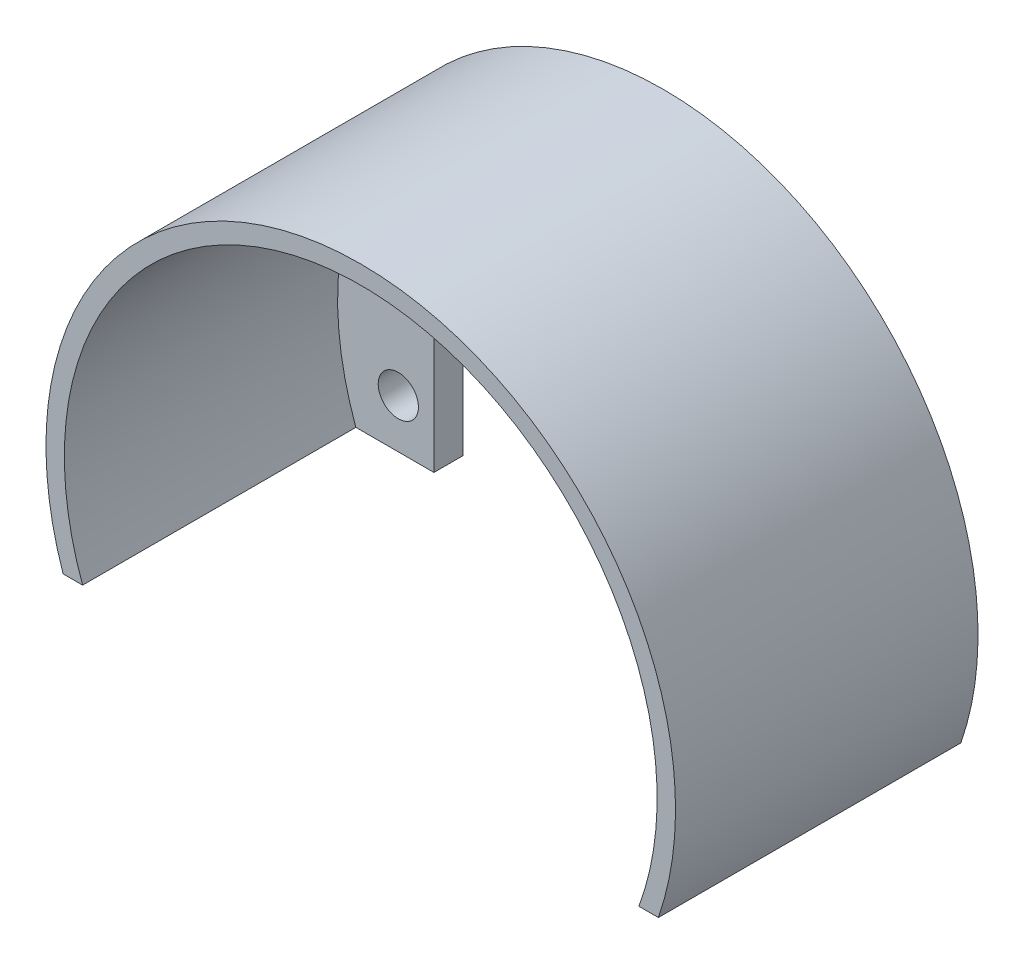
ISO-10303-21;
HEADER;
FILE_DESCRIPTION(('STEP AP214'),'2;1');
FILE_NAME('part.step','',(''),(''),'','','');
FILE_SCHEMA(('AUTOMOTIVE_DESIGN { 1 0 10303 214 1 1 1 1 }'));
ENDSEC;
DATA;
#1=APPLICATION_CONTEXT('core data for automotive mechanical design processes');
#2=APPLICATION_PROTOCOL_DEFINITION('international standard','automotive_design',2000,#1);
#3=PRODUCT_CONTEXT('',#1,'mechanical');
#4=PRODUCT('Part','Part','',(#3));
#5=PRODUCT_RELATED_PRODUCT_CATEGORY('part','',(#4));
#6=PRODUCT_DEFINITION_FORMATION('','',#4);
#7=PRODUCT_DEFINITION_CONTEXT('part definition',#1,'design');
#8=PRODUCT_DEFINITION('design','',#6,#7);
#9=PRODUCT_DEFINITION_SHAPE('','',#8);
#10=(LENGTH_UNIT() NAMED_UNIT(*) SI_UNIT(.MILLI.,.METRE.));
#11=(NAMED_UNIT(*) PLANE_ANGLE_UNIT() SI_UNIT($,.RADIAN.));
#12=(NAMED_UNIT(*) SI_UNIT($,.STERADIAN.) SOLID_ANGLE_UNIT());
#13=UNCERTAINTY_MEASURE_WITH_UNIT(LENGTH_MEASURE(1.E-05),#10,'distance_accuracy_value','');
#14=(GEOMETRIC_REPRESENTATION_CONTEXT(3) GLOBAL_UNCERTAINTY_ASSIGNED_CONTEXT((#13)) GLOBAL_UNIT_ASSIGNED_CONTEXT((#10,
#11,#12)) REPRESENTATION_CONTEXT('',''));
#15=CARTESIAN_POINT('',(0.,0.,0.));
#16=DIRECTION('',(0.,0.,1.));
#17=DIRECTION('',(1.,0.,0.));
#18=AXIS2_PLACEMENT_3D('',#15,#16,#17);
#19=CARTESIAN_POINT('',(2.85523596518771,11.6515735945376,3.));
#20=DIRECTION('',(0.,0.,-1.));
#21=DIRECTION('',(-1.,0.,0.));
#22=AXIS2_PLACEMENT_3D('',#19,#20,#21);
#23=PLANE('',#22);
#24=CARTESIAN_POINT('',(27.0052359651877,16.1515735945376,3.));
#25=DIRECTION('',(0.,0.,1.));
#26=DIRECTION('',(-1.,0.,0.));
#27=AXIS2_PLACEMENT_3D('',#24,#25,#26);
#28=CIRCLE('',#27,2.06094666766043);
#29=CARTESIAN_POINT('',(24.9442892975273,16.1515735945376,3.));
#30=VERTEX_POINT('',#29);
#31=EDGE_CURVE('E133',#30,#30,#28,.T.);
#32=ORIENTED_EDGE('',*,*,#31,.F.);
#33=EDGE_LOOP('',(#32));
#34=FACE_BOUND('',#33,.T.);
#35=CARTESIAN_POINT('',(-21.2947640348123,16.1515735945376,3.));
#36=DIRECTION('',(0.,0.,1.));
#37=DIRECTION('',(1.,0.,0.));
#38=AXIS2_PLACEMENT_3D('',#35,#36,#37);
#39=CIRCLE('',#38,2.06094666766043);
#40=CARTESIAN_POINT('',(-19.2338173671519,16.1515735945376,3.));
#41=VERTEX_POINT('',#40);
#42=EDGE_CURVE('E139',#41,#41,#39,.T.);
#43=ORIENTED_EDGE('',*,*,#42,.F.);
#44=EDGE_LOOP('',(#43));
#45=FACE_BOUND('',#44,.T.);
#46=CARTESIAN_POINT('',(-21.2947640348123,6.15157359453762,3.));
#47=DIRECTION('',(0.,0.,1.));
#48=DIRECTION('',(-1.,0.,0.));
#49=AXIS2_PLACEMENT_3D('',#46,#47,#48);
#50=CIRCLE('',#49,2.06094666766043);
#51=CARTESIAN_POINT('',(-23.3557107024727,6.15157359453762,3.));
#52=VERTEX_POINT('',#51);
#53=EDGE_CURVE('E145',#52,#52,#50,.T.);
#54=ORIENTED_EDGE('',*,*,#53,.F.);
#55=EDGE_LOOP('',(#54));
#56=FACE_BOUND('',#55,.T.);
#57=CARTESIAN_POINT('',(27.0052359651877,6.15157359453762,3.));
#58=DIRECTION('',(0.,0.,1.));
#59=DIRECTION('',(1.,0.,0.));
#60=AXIS2_PLACEMENT_3D('',#57,#58,#59);
#61=CIRCLE('',#60,2.06094666766043);
#62=CARTESIAN_POINT('',(29.0661826328481,6.15157359453762,3.));
#63=VERTEX_POINT('',#62);
#64=EDGE_CURVE('E151',#63,#63,#61,.T.);
#65=ORIENTED_EDGE('',*,*,#64,.F.);
#66=EDGE_LOOP('',(#65));
#67=FACE_BOUND('',#66,.T.);
#68=CARTESIAN_POINT('',(2.85523596518771,11.6515735945376,3.));
#69=DIRECTION('',(0.,0.,-1.));
#70=DIRECTION('',(-1.,0.,0.));
#71=AXIS2_PLACEMENT_3D('',#68,#69,#70);
#72=CIRCLE('',#71,30.3726850969749);
#73=CARTESIAN_POINT('',(-25.6447640348123,1.15157359453762,3.));
#74=VERTEX_POINT('',#73);
#75=CARTESIAN_POINT('',(31.3552359651877,1.15157359453763,3.));
#76=VERTEX_POINT('',#75);
#77=EDGE_CURVE('E48',#74,#76,#72,.T.);
#78=ORIENTED_EDGE('',*,*,#77,.F.);
#79=DIRECTION('',(1.,0.,0.));
#80=VECTOR('',#79,1.);
#81=CARTESIAN_POINT('',(-17.6447640348123,1.15157359453762,3.));
#82=LINE('',#81,#80);
#83=CARTESIAN_POINT('',(-17.6447640348123,1.15157359453762,3.));
#84=VERTEX_POINT('',#83);
#85=EDGE_CURVE('E87',#74,#84,#82,.T.);
#86=ORIENTED_EDGE('',*,*,#85,.T.);
#87=DIRECTION('',(0.,1.,0.));
#88=VECTOR('',#87,1.);
#89=CARTESIAN_POINT('',(-17.6447640348123,22.1515735945376,3.));
#90=LINE('',#89,#88);
#91=CARTESIAN_POINT('',(-17.6447640348123,22.1515735945376,3.));
#92=VERTEX_POINT('',#91);
#93=EDGE_CURVE('E157',#84,#92,#90,.T.);
#94=ORIENTED_EDGE('',*,*,#93,.T.);
#95=DIRECTION('',(1.,0.,0.));
#96=VECTOR('',#95,1.);
#97=CARTESIAN_POINT('',(-17.6447640348123,22.1515735945376,3.));
#98=LINE('',#97,#96);
#99=CARTESIAN_POINT('',(23.3552359651877,22.1515735945376,3.));
#100=VERTEX_POINT('',#99);
#101=EDGE_CURVE('E159',#92,#100,#98,.T.);
#102=ORIENTED_EDGE('',*,*,#101,.T.);
#103=DIRECTION('',(0.,-1.,0.));
#104=VECTOR('',#103,1.);
#105=CARTESIAN_POINT('',(23.3552359651877,22.1515735945376,3.));
#106=LINE('',#105,#104);
#107=CARTESIAN_POINT('',(23.3552359651877,1.15157359453762,3.));
#108=VERTEX_POINT('',#107);
#109=EDGE_CURVE('E55',#100,#108,#106,.T.);
#110=ORIENTED_EDGE('',*,*,#109,.T.);
#111=DIRECTION('',(1.,0.,0.));
#112=VECTOR('',#111,1.);
#113=CARTESIAN_POINT('',(23.3552359651877,1.15157359453762,3.));
#114=LINE('',#113,#112);
#115=EDGE_CURVE('E162',#108,#76,#114,.T.);
#116=ORIENTED_EDGE('',*,*,#115,.T.);
#117=EDGE_LOOP('',(#78,#86,#94,#102,#110,#116));
#118=FACE_BOUND('',#117,.T.);
#119=ADVANCED_FACE('F33',(#34,#45,#56,#67,#118),#23,.F.);
#120=CARTESIAN_POINT('',(2.85523596518771,11.6515735945376,0.));
#121=DIRECTION('',(0.,0.,-1.));
#122=DIRECTION('',(-1.,0.,0.));
#123=AXIS2_PLACEMENT_3D('',#120,#121,#122);
#124=PLANE('',#123);
#125=CARTESIAN_POINT('',(-21.2947640348123,16.1515735945376,0.));
#126=DIRECTION('',(0.,0.,1.));
#127=DIRECTION('',(1.,0.,0.));
#128=AXIS2_PLACEMENT_3D('',#125,#126,#127);
#129=CIRCLE('',#128,2.06094666766043);
#130=CARTESIAN_POINT('',(-19.2338173671519,16.1515735945376,0.));
#131=VERTEX_POINT('',#130);
#132=EDGE_CURVE('E136',#131,#131,#129,.T.);
#133=ORIENTED_EDGE('',*,*,#132,.T.);
#134=EDGE_LOOP('',(#133));
#135=FACE_BOUND('',#134,.T.);
#136=CARTESIAN_POINT('',(27.0052359651877,6.15157359453762,0.));
#137=DIRECTION('',(0.,0.,1.));
#138=DIRECTION('',(1.,0.,0.));
#139=AXIS2_PLACEMENT_3D('',#136,#137,#138);
#140=CIRCLE('',#139,2.06094666766043);
#141=CARTESIAN_POINT('',(29.0661826328481,6.15157359453762,0.));
#142=VERTEX_POINT('',#141);
#143=EDGE_CURVE('E148',#142,#142,#140,.T.);
#144=ORIENTED_EDGE('',*,*,#143,.T.);
#145=EDGE_LOOP('',(#144));
#146=FACE_BOUND('',#145,.T.);
#147=CARTESIAN_POINT('',(2.85523596518771,11.6515735945376,0.));
#148=DIRECTION('',(0.,0.,1.));
#149=DIRECTION('',(-1.,0.,0.));
#150=AXIS2_PLACEMENT_3D('',#147,#148,#149);
#151=CIRCLE('',#150,32.2567822325786);
#152=CARTESIAN_POINT('',(33.3552359651877,1.15157359453762,0.));
#153=VERTEX_POINT('',#152);
#154=CARTESIAN_POINT('',(-27.6447640348123,1.15157359453762,0.));
#155=VERTEX_POINT('',#154);
#156=EDGE_CURVE('E108',#153,#155,#151,.T.);
#157=ORIENTED_EDGE('',*,*,#156,.F.);
#158=DIRECTION('',(1.,0.,0.));
#159=VECTOR('',#158,1.);
#160=CARTESIAN_POINT('',(23.3552359651877,1.15157359453762,0.));
#161=LINE('',#160,#159);
#162=CARTESIAN_POINT('',(23.3552359651877,1.15157359453762,0.));
#163=VERTEX_POINT('',#162);
#164=EDGE_CURVE('E83',#163,#153,#161,.T.);
#165=ORIENTED_EDGE('',*,*,#164,.F.);
#166=DIRECTION('',(0.,-1.,0.));
#167=VECTOR('',#166,1.);
#168=CARTESIAN_POINT('',(23.3552359651877,22.1515735945376,0.));
#169=LINE('',#168,#167);
#170=CARTESIAN_POINT('',(23.3552359651877,22.1515735945376,0.));
#171=VERTEX_POINT('',#170);
#172=EDGE_CURVE('E172',#171,#163,#169,.T.);
#173=ORIENTED_EDGE('',*,*,#172,.F.);
#174=DIRECTION('',(1.,0.,0.));
#175=VECTOR('',#174,1.);
#176=CARTESIAN_POINT('',(-17.6447640348123,22.1515735945376,0.));
#177=LINE('',#176,#175);
#178=CARTESIAN_POINT('',(-17.6447640348123,22.1515735945376,0.));
#179=VERTEX_POINT('',#178);
#180=EDGE_CURVE('E170',#179,#171,#177,.T.);
#181=ORIENTED_EDGE('',*,*,#180,.F.);
#182=DIRECTION('',(0.,1.,0.));
#183=VECTOR('',#182,1.);
#184=CARTESIAN_POINT('',(-17.6447640348123,22.1515735945376,0.));
#185=LINE('',#184,#183);
#186=CARTESIAN_POINT('',(-17.6447640348123,1.15157359453762,0.));
#187=VERTEX_POINT('',#186);
#188=EDGE_CURVE('E168',#187,#179,#185,.T.);
#189=ORIENTED_EDGE('',*,*,#188,.F.);
#190=DIRECTION('',(1.,0.,0.));
#191=VECTOR('',#190,1.);
#192=CARTESIAN_POINT('',(-17.6447640348123,1.15157359453762,0.));
#193=LINE('',#192,#191);
#194=EDGE_CURVE('E166',#155,#187,#193,.T.);
#195=ORIENTED_EDGE('',*,*,#194,.F.);
#196=EDGE_LOOP('',(#157,#165,#173,#181,#189,#195));
#197=FACE_BOUND('',#196,.T.);
#198=CARTESIAN_POINT('',(-21.2947640348123,6.15157359453762,0.));
#199=DIRECTION('',(0.,0.,1.));
#200=DIRECTION('',(-1.,0.,0.));
#201=AXIS2_PLACEMENT_3D('',#198,#199,#200);
#202=CIRCLE('',#201,2.06094666766043);
#203=CARTESIAN_POINT('',(-23.3557107024727,6.15157359453762,0.));
#204=VERTEX_POINT('',#203);
#205=EDGE_CURVE('E142',#204,#204,#202,.T.);
#206=ORIENTED_EDGE('',*,*,#205,.T.);
#207=EDGE_LOOP('',(#206));
#208=FACE_BOUND('',#207,.T.);
#209=CARTESIAN_POINT('',(27.0052359651877,16.1515735945376,0.));
#210=DIRECTION('',(0.,0.,1.));
#211=DIRECTION('',(-1.,0.,0.));
#212=AXIS2_PLACEMENT_3D('',#209,#210,#211);
#213=CIRCLE('',#212,2.06094666766043);
#214=CARTESIAN_POINT('',(24.9442892975273,16.1515735945376,0.));
#215=VERTEX_POINT('',#214);
#216=EDGE_CURVE('E132',#215,#215,#213,.T.);
#217=ORIENTED_EDGE('',*,*,#216,.T.);
#218=EDGE_LOOP('',(#217));
#219=FACE_BOUND('',#218,.T.);
#220=ADVANCED_FACE('F191',(#135,#146,#197,#208,#219),#124,.T.);
#221=CARTESIAN_POINT('',(2.85523596518771,11.6515735945376,3.));
#222=DIRECTION('',(0.,0.,-1.));
#223=DIRECTION('',(-1.,0.,0.));
#224=AXIS2_PLACEMENT_3D('',#221,#222,#223);
#225=CYLINDRICAL_SURFACE('',#224,32.2567822325786);
#226=ORIENTED_EDGE('',*,*,#156,.T.);
#227=DIRECTION('',(0.,0.,-1.));
#228=VECTOR('',#227,1.);
#229=CARTESIAN_POINT('',(-27.6447640348123,1.15157359453762,3.));
#230=LINE('',#229,#228);
#231=CARTESIAN_POINT('',(-27.6447640348123,1.15157359453762,31.));
#232=VERTEX_POINT('',#231);
#233=EDGE_CURVE('E11',#232,#155,#230,.T.);
#234=ORIENTED_EDGE('',*,*,#233,.F.);
#235=CARTESIAN_POINT('',(2.85523596518771,11.6515735945376,31.));
#236=DIRECTION('',(0.,0.,1.));
#237=DIRECTION('',(-1.,0.,0.));
#238=AXIS2_PLACEMENT_3D('',#235,#236,#237);
#239=CIRCLE('',#238,32.2567822325786);
#240=CARTESIAN_POINT('',(33.3552359651877,1.15157359453762,31.));
#241=VERTEX_POINT('',#240);
#242=EDGE_CURVE('E106',#241,#232,#239,.T.);
#243=ORIENTED_EDGE('',*,*,#242,.F.);
#244=DIRECTION('',(0.,0.,-1.));
#245=VECTOR('',#244,1.);
#246=CARTESIAN_POINT('',(33.3552359651877,1.15157359453762,3.));
#247=LINE('',#246,#245);
#248=EDGE_CURVE('E164',#241,#153,#247,.T.);
#249=ORIENTED_EDGE('',*,*,#248,.T.);
#250=EDGE_LOOP('',(#226,#234,#243,#249));
#251=FACE_BOUND('',#250,.T.);
#252=ADVANCED_FACE('F35',(#251),#225,.T.);
#253=CARTESIAN_POINT('',(-17.6447640348123,1.15157359453762,3.));
#254=DIRECTION('',(0.,1.,0.));
#255=DIRECTION('',(-1.,0.,0.));
#256=AXIS2_PLACEMENT_3D('',#253,#254,#255);
#257=PLANE('',#256);
#258=ORIENTED_EDGE('',*,*,#194,.T.);
#259=DIRECTION('',(0.,0.,-1.));
#260=VECTOR('',#259,1.);
#261=CARTESIAN_POINT('',(-17.6447640348123,1.15157359453762,3.));
#262=LINE('',#261,#260);
#263=EDGE_CURVE('E41',#84,#187,#262,.T.);
#264=ORIENTED_EDGE('',*,*,#263,.F.);
#265=ORIENTED_EDGE('',*,*,#85,.F.);
#266=DIRECTION('',(0.,0.,-1.));
#267=VECTOR('',#266,1.);
#268=CARTESIAN_POINT('',(-25.6447640348123,1.15157359453762,31.));
#269=LINE('',#268,#267);
#270=CARTESIAN_POINT('',(-25.6447640348123,1.15157359453762,31.));
#271=VERTEX_POINT('',#270);
#272=EDGE_CURVE('E114',#271,#74,#269,.T.);
#273=ORIENTED_EDGE('',*,*,#272,.F.);
#274=DIRECTION('',(1.,0.,0.));
#275=VECTOR('',#274,1.);
#276=CARTESIAN_POINT('',(-27.6447640348123,1.15157359453762,31.));
#277=LINE('',#276,#275);
#278=EDGE_CURVE('E111',#232,#271,#277,.T.);
#279=ORIENTED_EDGE('',*,*,#278,.F.);
#280=ORIENTED_EDGE('',*,*,#233,.T.);
#281=EDGE_LOOP('',(#258,#264,#265,#273,#279,#280));
#282=FACE_BOUND('',#281,.T.);
#283=ADVANCED_FACE('F112',(#282),#257,.F.);
#284=CARTESIAN_POINT('',(-17.6447640348123,22.1515735945376,3.));
#285=DIRECTION('',(-1.,0.,0.));
#286=DIRECTION('',(0.,-1.,0.));
#287=AXIS2_PLACEMENT_3D('',#284,#285,#286);
#288=PLANE('',#287);
#289=ORIENTED_EDGE('',*,*,#188,.T.);
#290=DIRECTION('',(0.,0.,-1.));
#291=VECTOR('',#290,1.);
#292=CARTESIAN_POINT('',(-17.6447640348123,22.1515735945376,3.));
#293=LINE('',#292,#291);
#294=EDGE_CURVE('E181',#92,#179,#293,.T.);
#295=ORIENTED_EDGE('',*,*,#294,.F.);
#296=ORIENTED_EDGE('',*,*,#93,.F.);
#297=ORIENTED_EDGE('',*,*,#263,.T.);
#298=EDGE_LOOP('',(#289,#295,#296,#297));
#299=FACE_BOUND('',#298,.T.);
#300=ADVANCED_FACE('F187',(#299),#288,.F.);
#301=CARTESIAN_POINT('',(-17.6447640348123,22.1515735945376,3.));
#302=DIRECTION('',(0.,1.,0.));
#303=DIRECTION('',(-1.,0.,0.));
#304=AXIS2_PLACEMENT_3D('',#301,#302,#303);
#305=PLANE('',#304);
#306=ORIENTED_EDGE('',*,*,#180,.T.);
#307=DIRECTION('',(0.,0.,-1.));
#308=VECTOR('',#307,1.);
#309=CARTESIAN_POINT('',(23.3552359651877,22.1515735945376,3.));
#310=LINE('',#309,#308);
#311=EDGE_CURVE('E178',#100,#171,#310,.T.);
#312=ORIENTED_EDGE('',*,*,#311,.F.);
#313=ORIENTED_EDGE('',*,*,#101,.F.);
#314=ORIENTED_EDGE('',*,*,#294,.T.);
#315=EDGE_LOOP('',(#306,#312,#313,#314));
#316=FACE_BOUND('',#315,.T.);
#317=ADVANCED_FACE('F196',(#316),#305,.F.);
#318=CARTESIAN_POINT('',(23.3552359651877,22.1515735945376,3.));
#319=DIRECTION('',(1.,0.,0.));
#320=DIRECTION('',(0.,1.,0.));
#321=AXIS2_PLACEMENT_3D('',#318,#319,#320);
#322=PLANE('',#321);
#323=ORIENTED_EDGE('',*,*,#172,.T.);
#324=DIRECTION('',(0.,0.,-1.));
#325=VECTOR('',#324,1.);
#326=CARTESIAN_POINT('',(23.3552359651877,1.15157359453762,3.));
#327=LINE('',#326,#325);
#328=EDGE_CURVE('E176',#108,#163,#327,.T.);
#329=ORIENTED_EDGE('',*,*,#328,.F.);
#330=ORIENTED_EDGE('',*,*,#109,.F.);
#331=ORIENTED_EDGE('',*,*,#311,.T.);
#332=EDGE_LOOP('',(#323,#329,#330,#331));
#333=FACE_BOUND('',#332,.T.);
#334=ADVANCED_FACE('F199',(#333),#322,.F.);
#335=CARTESIAN_POINT('',(23.3552359651877,1.15157359453762,3.));
#336=DIRECTION('',(0.,1.,0.));
#337=DIRECTION('',(-1.,0.,0.));
#338=AXIS2_PLACEMENT_3D('',#335,#336,#337);
#339=PLANE('',#338);
#340=ORIENTED_EDGE('',*,*,#164,.T.);
#341=ORIENTED_EDGE('',*,*,#248,.F.);
#342=DIRECTION('',(1.,0.,0.));
#343=VECTOR('',#342,1.);
#344=CARTESIAN_POINT('',(31.3552359651877,1.15157359453762,31.));
#345=LINE('',#344,#343);
#346=CARTESIAN_POINT('',(31.3552359651877,1.15157359453763,31.));
#347=VERTEX_POINT('',#346);
#348=EDGE_CURVE('E122',#347,#241,#345,.T.);
#349=ORIENTED_EDGE('',*,*,#348,.F.);
#350=DIRECTION('',(0.,0.,-1.));
#351=VECTOR('',#350,1.);
#352=CARTESIAN_POINT('',(31.3552359651877,1.15157359453763,31.));
#353=LINE('',#352,#351);
#354=EDGE_CURVE('E127',#347,#76,#353,.T.);
#355=ORIENTED_EDGE('',*,*,#354,.T.);
#356=ORIENTED_EDGE('',*,*,#115,.F.);
#357=ORIENTED_EDGE('',*,*,#328,.T.);
#358=EDGE_LOOP('',(#340,#341,#349,#355,#356,#357));
#359=FACE_BOUND('',#358,.T.);
#360=ADVANCED_FACE('F201',(#359),#339,.F.);
#361=CARTESIAN_POINT('',(27.0052359651877,6.15157359453762,3.));
#362=DIRECTION('',(0.,0.,-1.));
#363=DIRECTION('',(-1.,0.,0.));
#364=AXIS2_PLACEMENT_3D('',#361,#362,#363);
#365=CYLINDRICAL_SURFACE('',#364,2.06094666766043);
#366=ORIENTED_EDGE('',*,*,#64,.T.);
#367=EDGE_LOOP('',(#366));
#368=FACE_BOUND('',#367,.T.);
#369=ORIENTED_EDGE('',*,*,#143,.F.);
#370=EDGE_LOOP('',(#369));
#371=FACE_BOUND('',#370,.T.);
#372=ADVANCED_FACE('F227',(#368,#371),#365,.F.);
#373=CARTESIAN_POINT('',(-21.2947640348123,6.15157359453762,3.));
#374=DIRECTION('',(0.,0.,-1.));
#375=DIRECTION('',(-1.,0.,0.));
#376=AXIS2_PLACEMENT_3D('',#373,#374,#375);
#377=CYLINDRICAL_SURFACE('',#376,2.06094666766043);
#378=ORIENTED_EDGE('',*,*,#53,.T.);
#379=EDGE_LOOP('',(#378));
#380=FACE_BOUND('',#379,.T.);
#381=ORIENTED_EDGE('',*,*,#205,.F.);
#382=EDGE_LOOP('',(#381));
#383=FACE_BOUND('',#382,.T.);
#384=ADVANCED_FACE('F277',(#380,#383),#377,.F.);
#385=CARTESIAN_POINT('',(-21.2947640348123,16.1515735945376,3.));
#386=DIRECTION('',(0.,0.,-1.));
#387=DIRECTION('',(-1.,0.,0.));
#388=AXIS2_PLACEMENT_3D('',#385,#386,#387);
#389=CYLINDRICAL_SURFACE('',#388,2.06094666766043);
#390=ORIENTED_EDGE('',*,*,#42,.T.);
#391=EDGE_LOOP('',(#390));
#392=FACE_BOUND('',#391,.T.);
#393=ORIENTED_EDGE('',*,*,#132,.F.);
#394=EDGE_LOOP('',(#393));
#395=FACE_BOUND('',#394,.T.);
#396=ADVANCED_FACE('F213',(#392,#395),#389,.F.);
#397=CARTESIAN_POINT('',(27.0052359651877,16.1515735945376,3.));
#398=DIRECTION('',(0.,0.,-1.));
#399=DIRECTION('',(-1.,0.,0.));
#400=AXIS2_PLACEMENT_3D('',#397,#398,#399);
#401=CYLINDRICAL_SURFACE('',#400,2.06094666766043);
#402=ORIENTED_EDGE('',*,*,#31,.T.);
#403=EDGE_LOOP('',(#402));
#404=FACE_BOUND('',#403,.T.);
#405=ORIENTED_EDGE('',*,*,#216,.F.);
#406=EDGE_LOOP('',(#405));
#407=FACE_BOUND('',#406,.T.);
#408=ADVANCED_FACE('F206',(#404,#407),#401,.F.);
#409=CARTESIAN_POINT('',(2.85523596518771,11.6515735945376,31.));
#410=DIRECTION('',(0.,0.,-1.));
#411=DIRECTION('',(-1.,0.,0.));
#412=AXIS2_PLACEMENT_3D('',#409,#410,#411);
#413=CYLINDRICAL_SURFACE('',#412,30.3726850969749);
#414=ORIENTED_EDGE('',*,*,#77,.T.);
#415=ORIENTED_EDGE('',*,*,#354,.F.);
#416=CARTESIAN_POINT('',(2.85523596518771,11.6515735945376,31.));
#417=DIRECTION('',(0.,0.,-1.));
#418=DIRECTION('',(-1.,0.,0.));
#419=AXIS2_PLACEMENT_3D('',#416,#417,#418);
#420=CIRCLE('',#419,30.3726850969749);
#421=EDGE_CURVE('E117',#271,#347,#420,.T.);
#422=ORIENTED_EDGE('',*,*,#421,.F.);
#423=ORIENTED_EDGE('',*,*,#272,.T.);
#424=EDGE_LOOP('',(#414,#415,#422,#423));
#425=FACE_BOUND('',#424,.T.);
#426=ADVANCED_FACE('F204',(#425),#413,.F.);
#427=CARTESIAN_POINT('',(2.85523596518771,11.6515735945376,31.));
#428=DIRECTION('',(0.,0.,-1.));
#429=DIRECTION('',(-1.,0.,0.));
#430=AXIS2_PLACEMENT_3D('',#427,#428,#429);
#431=PLANE('',#430);
#432=ORIENTED_EDGE('',*,*,#242,.T.);
#433=ORIENTED_EDGE('',*,*,#278,.T.);
#434=ORIENTED_EDGE('',*,*,#421,.T.);
#435=ORIENTED_EDGE('',*,*,#348,.T.);
#436=EDGE_LOOP('',(#432,#433,#434,#435));
#437=FACE_BOUND('',#436,.T.);
#438=ADVANCED_FACE('F120',(#437),#431,.F.);
#439=CLOSED_SHELL('',(#119,#220,#252,#283,#300,#317,#334,#360,#372,#384,#396,#408,#426,#438));
#440=MANIFOLD_SOLID_BREP('B2',#439);
#441=ADVANCED_BREP_SHAPE_REPRESENTATION('',(#18,#440),#14);
#442=SHAPE_DEFINITION_REPRESENTATION(#9,#441);
ENDSEC;
END-ISO-10303-21;
